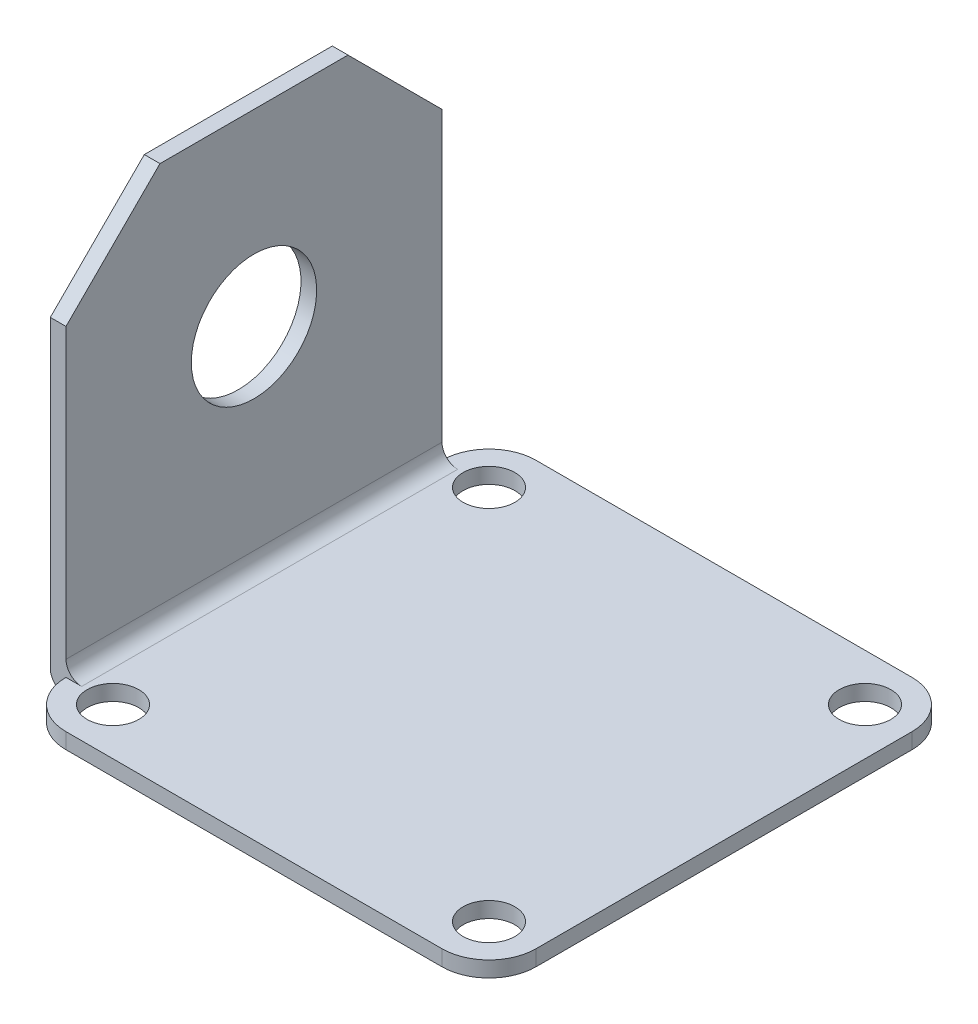
ISO-10303-21;
HEADER;
FILE_DESCRIPTION(('STEP AP214'),'2;1');
FILE_NAME('part.step','',(''),(''),'','','');
FILE_SCHEMA(('AUTOMOTIVE_DESIGN { 1 0 10303 214 1 1 1 1 }'));
ENDSEC;
DATA;
#1=APPLICATION_CONTEXT('core data for automotive mechanical design processes');
#2=APPLICATION_PROTOCOL_DEFINITION('international standard','automotive_design',2000,#1);
#3=PRODUCT_CONTEXT('',#1,'mechanical');
#4=PRODUCT('Part','Part','',(#3));
#5=PRODUCT_RELATED_PRODUCT_CATEGORY('part','',(#4));
#6=PRODUCT_DEFINITION_FORMATION('','',#4);
#7=PRODUCT_DEFINITION_CONTEXT('part definition',#1,'design');
#8=PRODUCT_DEFINITION('design','',#6,#7);
#9=PRODUCT_DEFINITION_SHAPE('','',#8);
#10=(LENGTH_UNIT() NAMED_UNIT(*) SI_UNIT(.MILLI.,.METRE.));
#11=(NAMED_UNIT(*) PLANE_ANGLE_UNIT() SI_UNIT($,.RADIAN.));
#12=(NAMED_UNIT(*) SI_UNIT($,.STERADIAN.) SOLID_ANGLE_UNIT());
#13=UNCERTAINTY_MEASURE_WITH_UNIT(LENGTH_MEASURE(1.E-05),#10,'distance_accuracy_value','');
#14=(GEOMETRIC_REPRESENTATION_CONTEXT(3) GLOBAL_UNCERTAINTY_ASSIGNED_CONTEXT((#13)) GLOBAL_UNIT_ASSIGNED_CONTEXT((#10,
#11,#12)) REPRESENTATION_CONTEXT('',''));
#15=CARTESIAN_POINT('',(0.,0.,0.));
#16=DIRECTION('',(0.,0.,1.));
#17=DIRECTION('',(1.,0.,0.));
#18=AXIS2_PLACEMENT_3D('',#15,#16,#17);
#19=CARTESIAN_POINT('',(3.,26.4,12.));
#20=DIRECTION('',(0.,-1.,0.));
#21=DIRECTION('',(0.,0.,-1.));
#22=AXIS2_PLACEMENT_3D('',#19,#20,#21);
#23=CYLINDRICAL_SURFACE('',#22,3.);
#24=CARTESIAN_POINT('',(3.,1.,12.));
#25=DIRECTION('',(0.,1.,0.));
#26=DIRECTION('',(0.,0.,1.));
#27=AXIS2_PLACEMENT_3D('',#24,#25,#26);
#28=CIRCLE('',#27,3.);
#29=CARTESIAN_POINT('',(0.,1.,12.));
#30=VERTEX_POINT('',#29);
#31=CARTESIAN_POINT('',(3.00000000000002,1.,15.));
#32=VERTEX_POINT('',#31);
#33=EDGE_CURVE('E282',#30,#32,#28,.T.);
#34=ORIENTED_EDGE('',*,*,#33,.F.);
#35=DIRECTION('',(0.,-1.,0.));
#36=VECTOR('',#35,1.);
#37=CARTESIAN_POINT('',(0.,26.4,12.));
#38=LINE('',#37,#36);
#39=CARTESIAN_POINT('',(0.,0.,12.));
#40=VERTEX_POINT('',#39);
#41=EDGE_CURVE('E188',#30,#40,#38,.T.);
#42=ORIENTED_EDGE('',*,*,#41,.T.);
#43=CARTESIAN_POINT('',(3.,0.,12.));
#44=DIRECTION('',(0.,1.,0.));
#45=DIRECTION('',(0.,0.,1.));
#46=AXIS2_PLACEMENT_3D('',#43,#44,#45);
#47=CIRCLE('',#46,3.);
#48=CARTESIAN_POINT('',(3.00000000000002,0.,15.));
#49=VERTEX_POINT('',#48);
#50=EDGE_CURVE('E296',#40,#49,#47,.T.);
#51=ORIENTED_EDGE('',*,*,#50,.T.);
#52=DIRECTION('',(0.,-1.,0.));
#53=VECTOR('',#52,1.);
#54=CARTESIAN_POINT('',(3.00000000000002,26.4,15.));
#55=LINE('',#54,#53);
#56=EDGE_CURVE('E186',#32,#49,#55,.T.);
#57=ORIENTED_EDGE('',*,*,#56,.F.);
#58=EDGE_LOOP('',(#34,#42,#51,#57));
#59=FACE_BOUND('',#58,.T.);
#60=ADVANCED_FACE('F32',(#59),#23,.T.);
#61=CARTESIAN_POINT('',(3.00000000000002,26.4,15.));
#62=DIRECTION('',(0.,0.,-1.));
#63=DIRECTION('',(-1.,0.,0.));
#64=AXIS2_PLACEMENT_3D('',#61,#62,#63);
#65=PLANE('',#64);
#66=DIRECTION('',(1.,0.,0.));
#67=VECTOR('',#66,1.);
#68=CARTESIAN_POINT('',(3.00000000000002,1.,15.));
#69=LINE('',#68,#67);
#70=CARTESIAN_POINT('',(27.,1.,15.));
#71=VERTEX_POINT('',#70);
#72=EDGE_CURVE('E280',#32,#71,#69,.T.);
#73=ORIENTED_EDGE('',*,*,#72,.F.);
#74=ORIENTED_EDGE('',*,*,#56,.T.);
#75=DIRECTION('',(1.,0.,0.));
#76=VECTOR('',#75,1.);
#77=CARTESIAN_POINT('',(3.00000000000002,0.,15.));
#78=LINE('',#77,#76);
#79=CARTESIAN_POINT('',(27.,0.,15.));
#80=VERTEX_POINT('',#79);
#81=EDGE_CURVE('E299',#49,#80,#78,.T.);
#82=ORIENTED_EDGE('',*,*,#81,.T.);
#83=DIRECTION('',(0.,-1.,0.));
#84=VECTOR('',#83,1.);
#85=CARTESIAN_POINT('',(27.,26.4,15.));
#86=LINE('',#85,#84);
#87=EDGE_CURVE('E184',#71,#80,#86,.T.);
#88=ORIENTED_EDGE('',*,*,#87,.F.);
#89=EDGE_LOOP('',(#73,#74,#82,#88));
#90=FACE_BOUND('',#89,.T.);
#91=ADVANCED_FACE('F334',(#90),#65,.F.);
#92=CARTESIAN_POINT('',(27.,26.4,12.));
#93=DIRECTION('',(0.,-1.,0.));
#94=DIRECTION('',(0.,0.,-1.));
#95=AXIS2_PLACEMENT_3D('',#92,#93,#94);
#96=CYLINDRICAL_SURFACE('',#95,3.);
#97=CARTESIAN_POINT('',(27.,1.,12.));
#98=DIRECTION('',(0.,1.,0.));
#99=DIRECTION('',(0.,0.,1.));
#100=AXIS2_PLACEMENT_3D('',#97,#98,#99);
#101=CIRCLE('',#100,3.);
#102=CARTESIAN_POINT('',(30.,1.,12.));
#103=VERTEX_POINT('',#102);
#104=EDGE_CURVE('E278',#71,#103,#101,.T.);
#105=ORIENTED_EDGE('',*,*,#104,.F.);
#106=ORIENTED_EDGE('',*,*,#87,.T.);
#107=CARTESIAN_POINT('',(27.,0.,12.));
#108=DIRECTION('',(0.,1.,0.));
#109=DIRECTION('',(0.,0.,1.));
#110=AXIS2_PLACEMENT_3D('',#107,#108,#109);
#111=CIRCLE('',#110,3.);
#112=CARTESIAN_POINT('',(30.,0.,12.));
#113=VERTEX_POINT('',#112);
#114=EDGE_CURVE('E302',#80,#113,#111,.T.);
#115=ORIENTED_EDGE('',*,*,#114,.T.);
#116=DIRECTION('',(0.,-1.,0.));
#117=VECTOR('',#116,1.);
#118=CARTESIAN_POINT('',(30.,26.4,12.));
#119=LINE('',#118,#117);
#120=EDGE_CURVE('E182',#103,#113,#119,.T.);
#121=ORIENTED_EDGE('',*,*,#120,.F.);
#122=EDGE_LOOP('',(#105,#106,#115,#121));
#123=FACE_BOUND('',#122,.T.);
#124=ADVANCED_FACE('F329',(#123),#96,.T.);
#125=CARTESIAN_POINT('',(30.,26.4,12.));
#126=DIRECTION('',(-1.,0.,0.));
#127=DIRECTION('',(0.,0.,1.));
#128=AXIS2_PLACEMENT_3D('',#125,#126,#127);
#129=PLANE('',#128);
#130=DIRECTION('',(0.,0.,-1.));
#131=VECTOR('',#130,1.);
#132=CARTESIAN_POINT('',(30.,1.,12.));
#133=LINE('',#132,#131);
#134=CARTESIAN_POINT('',(30.,1.,-12.));
#135=VERTEX_POINT('',#134);
#136=EDGE_CURVE('E276',#103,#135,#133,.T.);
#137=ORIENTED_EDGE('',*,*,#136,.F.);
#138=ORIENTED_EDGE('',*,*,#120,.T.);
#139=DIRECTION('',(0.,0.,-1.));
#140=VECTOR('',#139,1.);
#141=CARTESIAN_POINT('',(30.,0.,12.));
#142=LINE('',#141,#140);
#143=CARTESIAN_POINT('',(30.,0.,-12.));
#144=VERTEX_POINT('',#143);
#145=EDGE_CURVE('E305',#113,#144,#142,.T.);
#146=ORIENTED_EDGE('',*,*,#145,.T.);
#147=DIRECTION('',(0.,-1.,0.));
#148=VECTOR('',#147,1.);
#149=CARTESIAN_POINT('',(30.,26.4,-12.));
#150=LINE('',#149,#148);
#151=EDGE_CURVE('E180',#135,#144,#150,.T.);
#152=ORIENTED_EDGE('',*,*,#151,.F.);
#153=EDGE_LOOP('',(#137,#138,#146,#152));
#154=FACE_BOUND('',#153,.T.);
#155=ADVANCED_FACE('F325',(#154),#129,.F.);
#156=CARTESIAN_POINT('',(27.,26.4,-12.));
#157=DIRECTION('',(0.,-1.,0.));
#158=DIRECTION('',(0.,0.,-1.));
#159=AXIS2_PLACEMENT_3D('',#156,#157,#158);
#160=CYLINDRICAL_SURFACE('',#159,3.);
#161=CARTESIAN_POINT('',(27.,1.,-12.));
#162=DIRECTION('',(0.,1.,0.));
#163=DIRECTION('',(0.,0.,1.));
#164=AXIS2_PLACEMENT_3D('',#161,#162,#163);
#165=CIRCLE('',#164,3.);
#166=CARTESIAN_POINT('',(27.,1.,-15.));
#167=VERTEX_POINT('',#166);
#168=EDGE_CURVE('E274',#135,#167,#165,.T.);
#169=ORIENTED_EDGE('',*,*,#168,.F.);
#170=ORIENTED_EDGE('',*,*,#151,.T.);
#171=CARTESIAN_POINT('',(27.,0.,-12.));
#172=DIRECTION('',(0.,1.,0.));
#173=DIRECTION('',(0.,0.,1.));
#174=AXIS2_PLACEMENT_3D('',#171,#172,#173);
#175=CIRCLE('',#174,3.);
#176=CARTESIAN_POINT('',(27.,0.,-15.));
#177=VERTEX_POINT('',#176);
#178=EDGE_CURVE('E308',#144,#177,#175,.T.);
#179=ORIENTED_EDGE('',*,*,#178,.T.);
#180=DIRECTION('',(0.,-1.,0.));
#181=VECTOR('',#180,1.);
#182=CARTESIAN_POINT('',(27.,26.4,-15.));
#183=LINE('',#182,#181);
#184=EDGE_CURVE('E178',#167,#177,#183,.T.);
#185=ORIENTED_EDGE('',*,*,#184,.F.);
#186=EDGE_LOOP('',(#169,#170,#179,#185));
#187=FACE_BOUND('',#186,.T.);
#188=ADVANCED_FACE('F321',(#187),#160,.T.);
#189=CARTESIAN_POINT('',(27.,26.4,-15.));
#190=DIRECTION('',(0.,0.,1.));
#191=DIRECTION('',(1.,0.,0.));
#192=AXIS2_PLACEMENT_3D('',#189,#190,#191);
#193=PLANE('',#192);
#194=DIRECTION('',(-1.,0.,0.));
#195=VECTOR('',#194,1.);
#196=CARTESIAN_POINT('',(27.,1.,-15.));
#197=LINE('',#196,#195);
#198=CARTESIAN_POINT('',(3.00000000000002,1.,-15.));
#199=VERTEX_POINT('',#198);
#200=EDGE_CURVE('E241',#167,#199,#197,.T.);
#201=ORIENTED_EDGE('',*,*,#200,.F.);
#202=ORIENTED_EDGE('',*,*,#184,.T.);
#203=DIRECTION('',(-1.,0.,0.));
#204=VECTOR('',#203,1.);
#205=CARTESIAN_POINT('',(27.,0.,-15.));
#206=LINE('',#205,#204);
#207=CARTESIAN_POINT('',(3.00000000000002,0.,-15.));
#208=VERTEX_POINT('',#207);
#209=EDGE_CURVE('E169',#177,#208,#206,.T.);
#210=ORIENTED_EDGE('',*,*,#209,.T.);
#211=DIRECTION('',(0.,-1.,0.));
#212=VECTOR('',#211,1.);
#213=CARTESIAN_POINT('',(3.00000000000002,26.4,-15.));
#214=LINE('',#213,#212);
#215=EDGE_CURVE('E176',#199,#208,#214,.T.);
#216=ORIENTED_EDGE('',*,*,#215,.F.);
#217=EDGE_LOOP('',(#201,#202,#210,#216));
#218=FACE_BOUND('',#217,.T.);
#219=ADVANCED_FACE('F311',(#218),#193,.F.);
#220=CARTESIAN_POINT('',(3.,26.4,-12.));
#221=DIRECTION('',(0.,-1.,0.));
#222=DIRECTION('',(0.,0.,-1.));
#223=AXIS2_PLACEMENT_3D('',#220,#221,#222);
#224=CYLINDRICAL_SURFACE('',#223,3.);
#225=CARTESIAN_POINT('',(3.,1.,-12.));
#226=DIRECTION('',(0.,1.,0.));
#227=DIRECTION('',(0.,0.,1.));
#228=AXIS2_PLACEMENT_3D('',#225,#226,#227);
#229=CIRCLE('',#228,3.);
#230=CARTESIAN_POINT('',(0.,1.,-12.));
#231=VERTEX_POINT('',#230);
#232=EDGE_CURVE('E238',#199,#231,#229,.T.);
#233=ORIENTED_EDGE('',*,*,#232,.F.);
#234=ORIENTED_EDGE('',*,*,#215,.T.);
#235=CARTESIAN_POINT('',(3.,0.,-12.));
#236=DIRECTION('',(0.,1.,0.));
#237=DIRECTION('',(0.,0.,1.));
#238=AXIS2_PLACEMENT_3D('',#235,#236,#237);
#239=CIRCLE('',#238,3.);
#240=CARTESIAN_POINT('',(0.,0.,-12.));
#241=VERTEX_POINT('',#240);
#242=EDGE_CURVE('E164',#208,#241,#239,.T.);
#243=ORIENTED_EDGE('',*,*,#242,.T.);
#244=DIRECTION('',(0.,-1.,0.));
#245=VECTOR('',#244,1.);
#246=CARTESIAN_POINT('',(0.,26.4,-12.));
#247=LINE('',#246,#245);
#248=EDGE_CURVE('E166',#231,#241,#247,.T.);
#249=ORIENTED_EDGE('',*,*,#248,.F.);
#250=EDGE_LOOP('',(#233,#234,#243,#249));
#251=FACE_BOUND('',#250,.T.);
#252=ADVANCED_FACE('F246',(#251),#224,.T.);
#253=CARTESIAN_POINT('',(27.,26.4,12.));
#254=DIRECTION('',(0.,-1.,0.));
#255=DIRECTION('',(0.,0.,-1.));
#256=AXIS2_PLACEMENT_3D('',#253,#254,#255);
#257=CYLINDRICAL_SURFACE('',#256,1.65);
#258=CARTESIAN_POINT('',(27.,0.,12.));
#259=DIRECTION('',(0.,1.,0.));
#260=DIRECTION('',(0.,0.,1.));
#261=AXIS2_PLACEMENT_3D('',#258,#259,#260);
#262=CIRCLE('',#261,1.65);
#263=CARTESIAN_POINT('',(27.,0.,13.65));
#264=VERTEX_POINT('',#263);
#265=EDGE_CURVE('E293',#264,#264,#262,.T.);
#266=ORIENTED_EDGE('',*,*,#265,.F.);
#267=EDGE_LOOP('',(#266));
#268=FACE_BOUND('',#267,.T.);
#269=CARTESIAN_POINT('',(27.,1.,12.));
#270=DIRECTION('',(0.,1.,0.));
#271=DIRECTION('',(0.,0.,1.));
#272=AXIS2_PLACEMENT_3D('',#269,#270,#271);
#273=CIRCLE('',#272,1.65);
#274=CARTESIAN_POINT('',(27.,1.,13.65));
#275=VERTEX_POINT('',#274);
#276=EDGE_CURVE('E244',#275,#275,#273,.T.);
#277=ORIENTED_EDGE('',*,*,#276,.T.);
#278=EDGE_LOOP('',(#277));
#279=FACE_BOUND('',#278,.T.);
#280=ADVANCED_FACE('F385',(#268,#279),#257,.F.);
#281=CARTESIAN_POINT('',(3.00000000000001,26.4,12.));
#282=DIRECTION('',(0.,-1.,0.));
#283=DIRECTION('',(0.,0.,-1.));
#284=AXIS2_PLACEMENT_3D('',#281,#282,#283);
#285=CYLINDRICAL_SURFACE('',#284,1.65);
#286=CARTESIAN_POINT('',(3.00000000000001,0.,12.));
#287=DIRECTION('',(0.,1.,0.));
#288=DIRECTION('',(0.,0.,-1.));
#289=AXIS2_PLACEMENT_3D('',#286,#287,#288);
#290=CIRCLE('',#289,1.65);
#291=CARTESIAN_POINT('',(3.00000000000001,0.,10.35));
#292=VERTEX_POINT('',#291);
#293=EDGE_CURVE('E290',#292,#292,#290,.T.);
#294=ORIENTED_EDGE('',*,*,#293,.F.);
#295=EDGE_LOOP('',(#294));
#296=FACE_BOUND('',#295,.T.);
#297=CARTESIAN_POINT('',(3.00000000000001,1.,12.));
#298=DIRECTION('',(0.,1.,0.));
#299=DIRECTION('',(0.,0.,1.));
#300=AXIS2_PLACEMENT_3D('',#297,#298,#299);
#301=CIRCLE('',#300,1.65);
#302=CARTESIAN_POINT('',(3.00000000000001,1.,13.65));
#303=VERTEX_POINT('',#302);
#304=EDGE_CURVE('E268',#303,#303,#301,.T.);
#305=ORIENTED_EDGE('',*,*,#304,.T.);
#306=EDGE_LOOP('',(#305));
#307=FACE_BOUND('',#306,.T.);
#308=ADVANCED_FACE('F381',(#296,#307),#285,.F.);
#309=CARTESIAN_POINT('',(3.00000000000001,26.4,-12.));
#310=DIRECTION('',(0.,-1.,0.));
#311=DIRECTION('',(0.,0.,-1.));
#312=AXIS2_PLACEMENT_3D('',#309,#310,#311);
#313=CYLINDRICAL_SURFACE('',#312,1.65);
#314=CARTESIAN_POINT('',(3.00000000000001,0.,-12.));
#315=DIRECTION('',(0.,1.,0.));
#316=DIRECTION('',(0.,0.,1.));
#317=AXIS2_PLACEMENT_3D('',#314,#315,#316);
#318=CIRCLE('',#317,1.65);
#319=CARTESIAN_POINT('',(3.00000000000001,0.,-10.35));
#320=VERTEX_POINT('',#319);
#321=EDGE_CURVE('E287',#320,#320,#318,.T.);
#322=ORIENTED_EDGE('',*,*,#321,.F.);
#323=EDGE_LOOP('',(#322));
#324=FACE_BOUND('',#323,.T.);
#325=CARTESIAN_POINT('',(3.00000000000001,1.,-12.));
#326=DIRECTION('',(0.,1.,0.));
#327=DIRECTION('',(0.,0.,1.));
#328=AXIS2_PLACEMENT_3D('',#325,#326,#327);
#329=CIRCLE('',#328,1.65);
#330=CARTESIAN_POINT('',(3.00000000000001,1.,-10.35));
#331=VERTEX_POINT('',#330);
#332=EDGE_CURVE('E197',#331,#331,#329,.T.);
#333=ORIENTED_EDGE('',*,*,#332,.T.);
#334=EDGE_LOOP('',(#333));
#335=FACE_BOUND('',#334,.T.);
#336=ADVANCED_FACE('F377',(#324,#335),#313,.F.);
#337=CARTESIAN_POINT('',(27.,26.4,-12.));
#338=DIRECTION('',(0.,-1.,0.));
#339=DIRECTION('',(0.,0.,-1.));
#340=AXIS2_PLACEMENT_3D('',#337,#338,#339);
#341=CYLINDRICAL_SURFACE('',#340,1.65);
#342=CARTESIAN_POINT('',(27.,0.,-12.));
#343=DIRECTION('',(0.,1.,0.));
#344=DIRECTION('',(0.,0.,-1.));
#345=AXIS2_PLACEMENT_3D('',#342,#343,#344);
#346=CIRCLE('',#345,1.65);
#347=CARTESIAN_POINT('',(27.,0.,-13.65));
#348=VERTEX_POINT('',#347);
#349=EDGE_CURVE('E284',#348,#348,#346,.T.);
#350=ORIENTED_EDGE('',*,*,#349,.F.);
#351=EDGE_LOOP('',(#350));
#352=FACE_BOUND('',#351,.T.);
#353=CARTESIAN_POINT('',(27.,1.,-12.));
#354=DIRECTION('',(0.,1.,0.));
#355=DIRECTION('',(0.,0.,1.));
#356=AXIS2_PLACEMENT_3D('',#353,#354,#355);
#357=CIRCLE('',#356,1.65);
#358=CARTESIAN_POINT('',(27.,1.,-10.35));
#359=VERTEX_POINT('',#358);
#360=EDGE_CURVE('E194',#359,#359,#357,.T.);
#361=ORIENTED_EDGE('',*,*,#360,.T.);
#362=EDGE_LOOP('',(#361));
#363=FACE_BOUND('',#362,.T.);
#364=ADVANCED_FACE('F374',(#352,#363),#341,.F.);
#365=CARTESIAN_POINT('',(3.,26.4,12.));
#366=DIRECTION('',(0.,1.,0.));
#367=DIRECTION('',(0.,0.,1.));
#368=AXIS2_PLACEMENT_3D('',#365,#366,#367);
#369=PLANE('',#368);
#370=DIRECTION('',(-1.,0.,0.));
#371=VECTOR('',#370,1.);
#372=CARTESIAN_POINT('',(1.00000000000001,26.4,6.));
#373=LINE('',#372,#371);
#374=CARTESIAN_POINT('',(0.,26.4,6.));
#375=VERTEX_POINT('',#374);
#376=CARTESIAN_POINT('',(-0.999999999999994,26.4,6.));
#377=VERTEX_POINT('',#376);
#378=EDGE_CURVE('E138',#375,#377,#373,.T.);
#379=ORIENTED_EDGE('',*,*,#378,.F.);
#380=DIRECTION('',(0.,0.,1.));
#381=VECTOR('',#380,1.);
#382=CARTESIAN_POINT('',(0.,26.4,-16.5358170068647));
#383=LINE('',#382,#381);
#384=CARTESIAN_POINT('',(0.,26.4,-6.));
#385=VERTEX_POINT('',#384);
#386=EDGE_CURVE('E198',#385,#375,#383,.T.);
#387=ORIENTED_EDGE('',*,*,#386,.F.);
#388=DIRECTION('',(-1.,0.,0.));
#389=VECTOR('',#388,1.);
#390=CARTESIAN_POINT('',(1.00000000000001,26.4,-6.));
#391=LINE('',#390,#389);
#392=CARTESIAN_POINT('',(-0.999999999999994,26.4,-6.));
#393=VERTEX_POINT('',#392);
#394=EDGE_CURVE('E162',#385,#393,#391,.T.);
#395=ORIENTED_EDGE('',*,*,#394,.T.);
#396=DIRECTION('',(0.,0.,1.));
#397=VECTOR('',#396,1.);
#398=CARTESIAN_POINT('',(-0.999999999999995,26.4,-12.));
#399=LINE('',#398,#397);
#400=EDGE_CURVE('E155',#393,#377,#399,.T.);
#401=ORIENTED_EDGE('',*,*,#400,.T.);
#402=EDGE_LOOP('',(#379,#387,#395,#401));
#403=FACE_BOUND('',#402,.T.);
#404=ADVANCED_FACE('F161',(#403),#369,.T.);
#405=CARTESIAN_POINT('',(3.,0.,12.));
#406=DIRECTION('',(0.,1.,0.));
#407=DIRECTION('',(0.,0.,1.));
#408=AXIS2_PLACEMENT_3D('',#405,#406,#407);
#409=PLANE('',#408);
#410=ORIENTED_EDGE('',*,*,#321,.T.);
#411=EDGE_LOOP('',(#410));
#412=FACE_BOUND('',#411,.T.);
#413=ORIENTED_EDGE('',*,*,#265,.T.);
#414=EDGE_LOOP('',(#413));
#415=FACE_BOUND('',#414,.T.);
#416=ORIENTED_EDGE('',*,*,#50,.F.);
#417=DIRECTION('',(0.,0.,1.));
#418=VECTOR('',#417,1.);
#419=CARTESIAN_POINT('',(0.,0.,12.));
#420=LINE('',#419,#418);
#421=EDGE_CURVE('E218',#40,#241,#420,.F.);
#422=ORIENTED_EDGE('',*,*,#421,.T.);
#423=ORIENTED_EDGE('',*,*,#242,.F.);
#424=ORIENTED_EDGE('',*,*,#209,.F.);
#425=ORIENTED_EDGE('',*,*,#178,.F.);
#426=ORIENTED_EDGE('',*,*,#145,.F.);
#427=ORIENTED_EDGE('',*,*,#114,.F.);
#428=ORIENTED_EDGE('',*,*,#81,.F.);
#429=EDGE_LOOP('',(#416,#422,#423,#424,#425,#426,#427,#428));
#430=FACE_BOUND('',#429,.T.);
#431=ORIENTED_EDGE('',*,*,#293,.T.);
#432=EDGE_LOOP('',(#431));
#433=FACE_BOUND('',#432,.T.);
#434=ORIENTED_EDGE('',*,*,#349,.T.);
#435=EDGE_LOOP('',(#434));
#436=FACE_BOUND('',#435,.T.);
#437=ADVANCED_FACE('F315',(#412,#415,#430,#433,#436),#409,.F.);
#438=CARTESIAN_POINT('',(-0.999999999999995,26.4,-12.));
#439=DIRECTION('',(1.,0.,0.));
#440=DIRECTION('',(0.,0.,-1.));
#441=AXIS2_PLACEMENT_3D('',#438,#439,#440);
#442=PLANE('',#441);
#443=CARTESIAN_POINT('',(-0.999999999999994,14.4,0.));
#444=DIRECTION('',(-1.,0.,0.));
#445=DIRECTION('',(0.,0.,1.));
#446=AXIS2_PLACEMENT_3D('',#443,#444,#445);
#447=CIRCLE('',#446,4.);
#448=CARTESIAN_POINT('',(-0.999999999999994,14.4,4.));
#449=VERTEX_POINT('',#448);
#450=EDGE_CURVE('E202',#449,#449,#447,.T.);
#451=ORIENTED_EDGE('',*,*,#450,.F.);
#452=EDGE_LOOP('',(#451));
#453=FACE_BOUND('',#452,.T.);
#454=DIRECTION('',(0.,-1.,0.));
#455=VECTOR('',#454,1.);
#456=CARTESIAN_POINT('',(-0.999999999999995,26.4,-12.));
#457=LINE('',#456,#455);
#458=CARTESIAN_POINT('',(-0.999999999999995,20.4,-12.));
#459=VERTEX_POINT('',#458);
#460=CARTESIAN_POINT('',(-0.999999999999995,1.,-12.));
#461=VERTEX_POINT('',#460);
#462=EDGE_CURVE('E163',#459,#461,#457,.T.);
#463=ORIENTED_EDGE('',*,*,#462,.T.);
#464=DIRECTION('',(0.,0.,1.));
#465=VECTOR('',#464,1.);
#466=CARTESIAN_POINT('',(-0.999999999999995,1.,-12.));
#467=LINE('',#466,#465);
#468=CARTESIAN_POINT('',(-0.999999999999993,1.,12.));
#469=VERTEX_POINT('',#468);
#470=EDGE_CURVE('E214',#461,#469,#467,.T.);
#471=ORIENTED_EDGE('',*,*,#470,.T.);
#472=DIRECTION('',(0.,-1.,0.));
#473=VECTOR('',#472,1.);
#474=CARTESIAN_POINT('',(-0.999999999999993,26.4,12.));
#475=LINE('',#474,#473);
#476=CARTESIAN_POINT('',(-0.999999999999993,20.4,12.));
#477=VERTEX_POINT('',#476);
#478=EDGE_CURVE('E158',#477,#469,#475,.T.);
#479=ORIENTED_EDGE('',*,*,#478,.F.);
#480=DIRECTION('',(0.,-0.707106781186547,0.707106781186548));
#481=VECTOR('',#480,1.);
#482=CARTESIAN_POINT('',(-0.999999999999993,20.4,12.));
#483=LINE('',#482,#481);
#484=EDGE_CURVE('E141',#377,#477,#483,.T.);
#485=ORIENTED_EDGE('',*,*,#484,.F.);
#486=ORIENTED_EDGE('',*,*,#400,.F.);
#487=DIRECTION('',(0.,0.707106781186547,0.707106781186548));
#488=VECTOR('',#487,1.);
#489=CARTESIAN_POINT('',(-0.999999999999995,20.4,-12.));
#490=LINE('',#489,#488);
#491=EDGE_CURVE('E256',#459,#393,#490,.T.);
#492=ORIENTED_EDGE('',*,*,#491,.F.);
#493=EDGE_LOOP('',(#463,#471,#479,#485,#486,#492));
#494=FACE_BOUND('',#493,.T.);
#495=ADVANCED_FACE('F34',(#453,#494),#442,.F.);
#496=CARTESIAN_POINT('',(-0.999999999999993,26.4,12.));
#497=DIRECTION('',(0.,0.,-1.));
#498=DIRECTION('',(-1.,0.,0.));
#499=AXIS2_PLACEMENT_3D('',#496,#497,#498);
#500=PLANE('',#499);
#501=ORIENTED_EDGE('',*,*,#478,.T.);
#502=CARTESIAN_POINT('',(0.,1.,12.));
#503=DIRECTION('',(0.,0.,-1.));
#504=DIRECTION('',(-1.,0.,0.));
#505=AXIS2_PLACEMENT_3D('',#502,#503,#504);
#506=CIRCLE('',#505,1.);
#507=EDGE_CURVE('E216',#469,#40,#506,.F.);
#508=ORIENTED_EDGE('',*,*,#507,.T.);
#509=ORIENTED_EDGE('',*,*,#41,.F.);
#510=DIRECTION('',(-1.,0.,0.));
#511=VECTOR('',#510,1.);
#512=CARTESIAN_POINT('',(0.,1.,12.));
#513=LINE('',#512,#511);
#514=CARTESIAN_POINT('',(1.,1.,12.));
#515=VERTEX_POINT('',#514);
#516=EDGE_CURVE('E210',#515,#30,#513,.T.);
#517=ORIENTED_EDGE('',*,*,#516,.F.);
#518=CARTESIAN_POINT('',(1.,2.,12.));
#519=DIRECTION('',(0.,0.,-1.));
#520=DIRECTION('',(-1.,0.,0.));
#521=AXIS2_PLACEMENT_3D('',#518,#519,#520);
#522=CIRCLE('',#521,1.);
#523=CARTESIAN_POINT('',(0.,2.,12.));
#524=VERTEX_POINT('',#523);
#525=EDGE_CURVE('E40',#515,#524,#522,.T.);
#526=ORIENTED_EDGE('',*,*,#525,.T.);
#527=CARTESIAN_POINT('',(0.,20.4,12.));
#528=VERTEX_POINT('',#527);
#529=EDGE_CURVE('E189',#528,#524,#38,.T.);
#530=ORIENTED_EDGE('',*,*,#529,.F.);
#531=DIRECTION('',(-1.,0.,0.));
#532=VECTOR('',#531,1.);
#533=CARTESIAN_POINT('',(1.00000000000001,20.4,12.));
#534=LINE('',#533,#532);
#535=EDGE_CURVE('E149',#528,#477,#534,.T.);
#536=ORIENTED_EDGE('',*,*,#535,.T.);
#537=EDGE_LOOP('',(#501,#508,#509,#517,#526,#530,#536));
#538=FACE_BOUND('',#537,.T.);
#539=ADVANCED_FACE('F223',(#538),#500,.F.);
#540=CARTESIAN_POINT('',(0.,26.4,-12.));
#541=DIRECTION('',(0.,0.,1.));
#542=DIRECTION('',(1.,0.,0.));
#543=AXIS2_PLACEMENT_3D('',#540,#541,#542);
#544=PLANE('',#543);
#545=ORIENTED_EDGE('',*,*,#248,.T.);
#546=CARTESIAN_POINT('',(0.,1.,-12.));
#547=DIRECTION('',(0.,0.,1.));
#548=DIRECTION('',(1.,0.,0.));
#549=AXIS2_PLACEMENT_3D('',#546,#547,#548);
#550=CIRCLE('',#549,1.);
#551=EDGE_CURVE('E52',#241,#461,#550,.F.);
#552=ORIENTED_EDGE('',*,*,#551,.T.);
#553=ORIENTED_EDGE('',*,*,#462,.F.);
#554=DIRECTION('',(-1.,0.,0.));
#555=VECTOR('',#554,1.);
#556=CARTESIAN_POINT('',(1.00000000000001,20.4,-12.));
#557=LINE('',#556,#555);
#558=CARTESIAN_POINT('',(0.,20.4,-12.));
#559=VERTEX_POINT('',#558);
#560=EDGE_CURVE('E258',#559,#459,#557,.T.);
#561=ORIENTED_EDGE('',*,*,#560,.F.);
#562=CARTESIAN_POINT('',(0.,2.,-12.));
#563=VERTEX_POINT('',#562);
#564=EDGE_CURVE('E173',#559,#563,#247,.T.);
#565=ORIENTED_EDGE('',*,*,#564,.T.);
#566=CARTESIAN_POINT('',(1.,2.,-11.9999999999999));
#567=DIRECTION('',(0.,0.,1.));
#568=DIRECTION('',(1.,0.,0.));
#569=AXIS2_PLACEMENT_3D('',#566,#567,#568);
#570=CIRCLE('',#569,1.);
#571=CARTESIAN_POINT('',(1.,1.,-11.9999999999999));
#572=VERTEX_POINT('',#571);
#573=EDGE_CURVE('E11',#563,#572,#570,.T.);
#574=ORIENTED_EDGE('',*,*,#573,.T.);
#575=DIRECTION('',(1.,0.,0.));
#576=VECTOR('',#575,1.);
#577=CARTESIAN_POINT('',(8.81550807393855E-13,1.,-12.));
#578=LINE('',#577,#576);
#579=EDGE_CURVE('E46',#231,#572,#578,.T.);
#580=ORIENTED_EDGE('',*,*,#579,.F.);
#581=EDGE_LOOP('',(#545,#552,#553,#561,#565,#574,#580));
#582=FACE_BOUND('',#581,.T.);
#583=ADVANCED_FACE('F233',(#582),#544,.F.);
#584=CARTESIAN_POINT('',(0.,1.,-16.5358170068647));
#585=DIRECTION('',(-1.,0.,0.));
#586=DIRECTION('',(0.,0.,1.));
#587=AXIS2_PLACEMENT_3D('',#584,#585,#586);
#588=PLANE('',#587);
#589=CARTESIAN_POINT('',(0.,14.4,0.));
#590=DIRECTION('',(-1.,0.,0.));
#591=DIRECTION('',(0.,0.,1.));
#592=AXIS2_PLACEMENT_3D('',#589,#590,#591);
#593=CIRCLE('',#592,4.);
#594=CARTESIAN_POINT('',(0.,14.4,4.));
#595=VERTEX_POINT('',#594);
#596=EDGE_CURVE('E199',#595,#595,#593,.T.);
#597=ORIENTED_EDGE('',*,*,#596,.T.);
#598=EDGE_LOOP('',(#597));
#599=FACE_BOUND('',#598,.T.);
#600=ORIENTED_EDGE('',*,*,#529,.T.);
#601=DIRECTION('',(0.,0.,1.));
#602=VECTOR('',#601,1.);
#603=CARTESIAN_POINT('',(0.,2.,-16.5358170068647));
#604=LINE('',#603,#602);
#605=EDGE_CURVE('E212',#524,#563,#604,.F.);
#606=ORIENTED_EDGE('',*,*,#605,.T.);
#607=ORIENTED_EDGE('',*,*,#564,.F.);
#608=DIRECTION('',(0.,0.707106781186547,0.707106781186548));
#609=VECTOR('',#608,1.);
#610=CARTESIAN_POINT('',(0.,8.43209149656765,-23.9679085034324));
#611=LINE('',#610,#609);
#612=EDGE_CURVE('E193',#559,#385,#611,.T.);
#613=ORIENTED_EDGE('',*,*,#612,.T.);
#614=ORIENTED_EDGE('',*,*,#386,.T.);
#615=DIRECTION('',(0.,-0.707106781186547,0.707106781186548));
#616=VECTOR('',#615,1.);
#617=CARTESIAN_POINT('',(0.,24.9679085034324,7.43209149656764));
#618=LINE('',#617,#616);
#619=EDGE_CURVE('E144',#375,#528,#618,.T.);
#620=ORIENTED_EDGE('',*,*,#619,.T.);
#621=EDGE_LOOP('',(#600,#606,#607,#613,#614,#620));
#622=FACE_BOUND('',#621,.T.);
#623=ADVANCED_FACE('F229',(#599,#622),#588,.F.);
#624=CARTESIAN_POINT('',(0.,1.,16.2321912013306));
#625=DIRECTION('',(0.,1.,0.));
#626=DIRECTION('',(0.,0.,1.));
#627=AXIS2_PLACEMENT_3D('',#624,#625,#626);
#628=PLANE('',#627);
#629=ORIENTED_EDGE('',*,*,#360,.F.);
#630=EDGE_LOOP('',(#629));
#631=FACE_BOUND('',#630,.T.);
#632=ORIENTED_EDGE('',*,*,#332,.F.);
#633=EDGE_LOOP('',(#632));
#634=FACE_BOUND('',#633,.T.);
#635=ORIENTED_EDGE('',*,*,#304,.F.);
#636=EDGE_LOOP('',(#635));
#637=FACE_BOUND('',#636,.T.);
#638=ORIENTED_EDGE('',*,*,#276,.F.);
#639=EDGE_LOOP('',(#638));
#640=FACE_BOUND('',#639,.T.);
#641=DIRECTION('',(0.,0.,1.));
#642=VECTOR('',#641,1.);
#643=CARTESIAN_POINT('',(1.,1.,16.2321912013306));
#644=LINE('',#643,#642);
#645=EDGE_CURVE('E207',#572,#515,#644,.T.);
#646=ORIENTED_EDGE('',*,*,#645,.T.);
#647=ORIENTED_EDGE('',*,*,#516,.T.);
#648=ORIENTED_EDGE('',*,*,#33,.T.);
#649=ORIENTED_EDGE('',*,*,#72,.T.);
#650=ORIENTED_EDGE('',*,*,#104,.T.);
#651=ORIENTED_EDGE('',*,*,#136,.T.);
#652=ORIENTED_EDGE('',*,*,#168,.T.);
#653=ORIENTED_EDGE('',*,*,#200,.T.);
#654=ORIENTED_EDGE('',*,*,#232,.T.);
#655=ORIENTED_EDGE('',*,*,#579,.T.);
#656=EDGE_LOOP('',(#646,#647,#648,#649,#650,#651,#652,#653,#654,#655));
#657=FACE_BOUND('',#656,.T.);
#658=ADVANCED_FACE('F236',(#631,#634,#637,#640,#657),#628,.T.);
#659=CARTESIAN_POINT('',(1.00000000000001,14.4,0.));
#660=DIRECTION('',(-1.,0.,0.));
#661=DIRECTION('',(0.,0.,1.));
#662=AXIS2_PLACEMENT_3D('',#659,#660,#661);
#663=CYLINDRICAL_SURFACE('',#662,4.);
#664=ORIENTED_EDGE('',*,*,#450,.T.);
#665=EDGE_LOOP('',(#664));
#666=FACE_BOUND('',#665,.T.);
#667=ORIENTED_EDGE('',*,*,#596,.F.);
#668=EDGE_LOOP('',(#667));
#669=FACE_BOUND('',#668,.T.);
#670=ADVANCED_FACE('F359',(#666,#669),#663,.F.);
#671=CARTESIAN_POINT('',(1.00000000000001,20.4,-12.));
#672=DIRECTION('',(0.,-0.707106781186548,0.707106781186547));
#673=DIRECTION('',(0.,-0.707106781186547,-0.707106781186548));
#674=AXIS2_PLACEMENT_3D('',#671,#672,#673);
#675=PLANE('',#674);
#676=ORIENTED_EDGE('',*,*,#560,.T.);
#677=ORIENTED_EDGE('',*,*,#491,.T.);
#678=ORIENTED_EDGE('',*,*,#394,.F.);
#679=ORIENTED_EDGE('',*,*,#612,.F.);
#680=EDGE_LOOP('',(#676,#677,#678,#679));
#681=FACE_BOUND('',#680,.T.);
#682=ADVANCED_FACE('F362',(#681),#675,.F.);
#683=CARTESIAN_POINT('',(1.00000000000001,20.4,12.));
#684=DIRECTION('',(0.,-0.707106781186548,-0.707106781186547));
#685=DIRECTION('',(0.,0.707106781186547,-0.707106781186548));
#686=AXIS2_PLACEMENT_3D('',#683,#684,#685);
#687=PLANE('',#686);
#688=ORIENTED_EDGE('',*,*,#378,.T.);
#689=ORIENTED_EDGE('',*,*,#484,.T.);
#690=ORIENTED_EDGE('',*,*,#535,.F.);
#691=ORIENTED_EDGE('',*,*,#619,.F.);
#692=EDGE_LOOP('',(#688,#689,#690,#691));
#693=FACE_BOUND('',#692,.T.);
#694=ADVANCED_FACE('F140',(#693),#687,.F.);
#695=CARTESIAN_POINT('',(1.,2.,16.2321912013306));
#696=DIRECTION('',(0.,0.,1.));
#697=DIRECTION('',(1.,0.,0.));
#698=AXIS2_PLACEMENT_3D('',#695,#696,#697);
#699=CYLINDRICAL_SURFACE('',#698,1.);
#700=ORIENTED_EDGE('',*,*,#573,.F.);
#701=ORIENTED_EDGE('',*,*,#605,.F.);
#702=ORIENTED_EDGE('',*,*,#525,.F.);
#703=ORIENTED_EDGE('',*,*,#645,.F.);
#704=EDGE_LOOP('',(#700,#701,#702,#703));
#705=FACE_BOUND('',#704,.T.);
#706=ADVANCED_FACE('F232',(#705),#699,.F.);
#707=CARTESIAN_POINT('',(0.,1.,-12.));
#708=DIRECTION('',(0.,0.,1.));
#709=DIRECTION('',(1.,0.,0.));
#710=AXIS2_PLACEMENT_3D('',#707,#708,#709);
#711=CYLINDRICAL_SURFACE('',#710,1.);
#712=ORIENTED_EDGE('',*,*,#551,.F.);
#713=ORIENTED_EDGE('',*,*,#421,.F.);
#714=ORIENTED_EDGE('',*,*,#507,.F.);
#715=ORIENTED_EDGE('',*,*,#470,.F.);
#716=EDGE_LOOP('',(#712,#713,#714,#715));
#717=FACE_BOUND('',#716,.T.);
#718=ADVANCED_FACE('F254',(#717),#711,.T.);
#719=CLOSED_SHELL('',(#60,#91,#124,#155,#188,#219,#252,#280,#308,#336,#364,#404,#437,#495,#539,
#583,#623,#658,#670,#682,#694,#706,#718));
#720=MANIFOLD_SOLID_BREP('B2',#719);
#721=ADVANCED_BREP_SHAPE_REPRESENTATION('',(#18,#720),#14);
#722=SHAPE_DEFINITION_REPRESENTATION(#9,#721);
ENDSEC;
END-ISO-10303-21;
